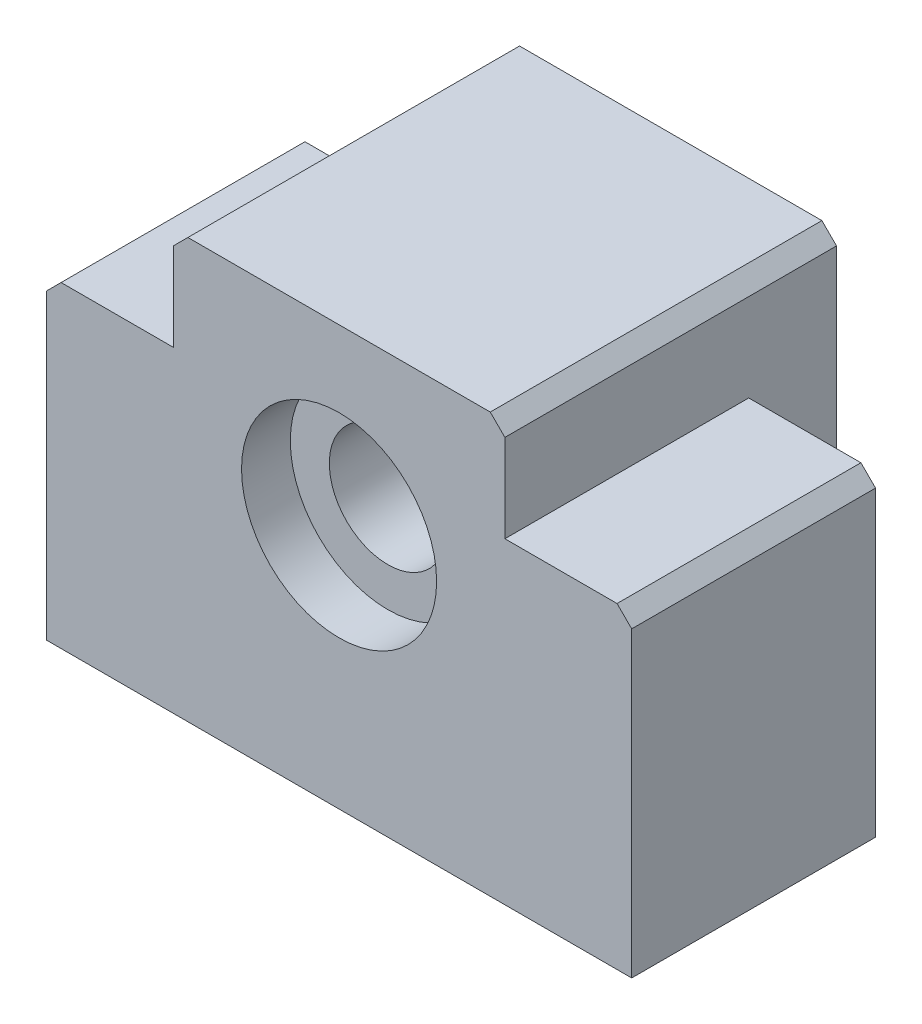
ISO-10303-21;
HEADER;
FILE_DESCRIPTION(('STEP AP214'),'2;1');
FILE_NAME('part.step','',(''),(''),'','','');
FILE_SCHEMA(('AUTOMOTIVE_DESIGN { 1 0 10303 214 1 1 1 1 }'));
ENDSEC;
DATA;
#1=APPLICATION_CONTEXT('core data for automotive mechanical design processes');
#2=APPLICATION_PROTOCOL_DEFINITION('international standard','automotive_design',2000,#1);
#3=PRODUCT_CONTEXT('',#1,'mechanical');
#4=PRODUCT('Part','Part','',(#3));
#5=PRODUCT_RELATED_PRODUCT_CATEGORY('part','',(#4));
#6=PRODUCT_DEFINITION_FORMATION('','',#4);
#7=PRODUCT_DEFINITION_CONTEXT('part definition',#1,'design');
#8=PRODUCT_DEFINITION('design','',#6,#7);
#9=PRODUCT_DEFINITION_SHAPE('','',#8);
#10=(LENGTH_UNIT() NAMED_UNIT(*) SI_UNIT(.MILLI.,.METRE.));
#11=(NAMED_UNIT(*) PLANE_ANGLE_UNIT() SI_UNIT($,.RADIAN.));
#12=(NAMED_UNIT(*) SI_UNIT($,.STERADIAN.) SOLID_ANGLE_UNIT());
#13=UNCERTAINTY_MEASURE_WITH_UNIT(LENGTH_MEASURE(1.E-05),#10,'distance_accuracy_value','');
#14=(GEOMETRIC_REPRESENTATION_CONTEXT(3) GLOBAL_UNCERTAINTY_ASSIGNED_CONTEXT((#13)) GLOBAL_UNIT_ASSIGNED_CONTEXT((#10,
#11,#12)) REPRESENTATION_CONTEXT('',''));
#15=CARTESIAN_POINT('',(0.,0.,0.));
#16=DIRECTION('',(0.,0.,1.));
#17=DIRECTION('',(1.,0.,0.));
#18=AXIS2_PLACEMENT_3D('',#15,#16,#17);
#19=CARTESIAN_POINT('',(-2.37420731041335E-13,8.95,-9.00000000000033));
#20=DIRECTION('',(0.,0.,1.));
#21=DIRECTION('',(1.,0.,0.));
#22=AXIS2_PLACEMENT_3D('',#19,#20,#21);
#23=CYLINDRICAL_SURFACE('',#22,6.);
#24=CARTESIAN_POINT('',(-1.32676290876039E-13,8.95,6.));
#25=DIRECTION('',(0.,0.,1.));
#26=DIRECTION('',(1.,0.,0.));
#27=AXIS2_PLACEMENT_3D('',#24,#25,#26);
#28=CIRCLE('',#27,6.);
#29=CARTESIAN_POINT('',(5.99999999999987,8.95,6.));
#30=VERTEX_POINT('',#29);
#31=EDGE_CURVE('E245',#30,#30,#28,.T.);
#32=ORIENTED_EDGE('',*,*,#31,.F.);
#33=EDGE_LOOP('',(#32));
#34=FACE_BOUND('',#33,.T.);
#35=CARTESIAN_POINT('',(0.,8.95,20.));
#36=DIRECTION('',(0.,0.,1.));
#37=DIRECTION('',(1.,0.,0.));
#38=AXIS2_PLACEMENT_3D('',#35,#36,#37);
#39=CIRCLE('',#38,6.);
#40=CARTESIAN_POINT('',(5.99999999999997,8.95,20.));
#41=VERTEX_POINT('',#40);
#42=EDGE_CURVE('E47',#41,#41,#39,.T.);
#43=ORIENTED_EDGE('',*,*,#42,.T.);
#44=EDGE_LOOP('',(#43));
#45=FACE_BOUND('',#44,.T.);
#46=ADVANCED_FACE('F42',(#34,#45),#23,.F.);
#47=CARTESIAN_POINT('',(-30.,16.25,25.));
#48=DIRECTION('',(0.,-1.,0.));
#49=DIRECTION('',(0.,0.,-1.));
#50=AXIS2_PLACEMENT_3D('',#47,#48,#49);
#51=PLANE('',#50);
#52=DIRECTION('',(-1.,0.,0.));
#53=VECTOR('',#52,1.);
#54=CARTESIAN_POINT('',(-30.,16.25,0.));
#55=LINE('',#54,#53);
#56=CARTESIAN_POINT('',(-17.0000000000002,16.25,0.));
#57=VERTEX_POINT('',#56);
#58=CARTESIAN_POINT('',(-28.5,16.25,0.));
#59=VERTEX_POINT('',#58);
#60=EDGE_CURVE('E196',#57,#59,#55,.T.);
#61=ORIENTED_EDGE('',*,*,#60,.T.);
#62=DIRECTION('',(0.,0.,1.));
#63=VECTOR('',#62,1.);
#64=CARTESIAN_POINT('',(-28.5,16.25,25.));
#65=LINE('',#64,#63);
#66=CARTESIAN_POINT('',(-28.5,16.25,25.));
#67=VERTEX_POINT('',#66);
#68=EDGE_CURVE('E239',#59,#67,#65,.T.);
#69=ORIENTED_EDGE('',*,*,#68,.T.);
#70=DIRECTION('',(-1.,0.,0.));
#71=VECTOR('',#70,1.);
#72=CARTESIAN_POINT('',(-30.,16.25,25.));
#73=LINE('',#72,#71);
#74=CARTESIAN_POINT('',(-17.,16.25,25.));
#75=VERTEX_POINT('',#74);
#76=EDGE_CURVE('E186',#75,#67,#73,.T.);
#77=ORIENTED_EDGE('',*,*,#76,.F.);
#78=DIRECTION('',(0.,0.,1.));
#79=VECTOR('',#78,1.);
#80=CARTESIAN_POINT('',(-17.,16.25,24.9999999999999));
#81=LINE('',#80,#79);
#82=EDGE_CURVE('E176',#57,#75,#81,.T.);
#83=ORIENTED_EDGE('',*,*,#82,.F.);
#84=EDGE_LOOP('',(#61,#69,#77,#83));
#85=FACE_BOUND('',#84,.T.);
#86=ADVANCED_FACE('F305',(#85),#51,.F.);
#87=CARTESIAN_POINT('',(28.5,16.25,25.));
#88=VERTEX_POINT('',#87);
#89=CARTESIAN_POINT('',(17.,16.25,25.));
#90=VERTEX_POINT('',#89);
#91=EDGE_CURVE('E188',#88,#90,#73,.T.);
#92=ORIENTED_EDGE('',*,*,#91,.F.);
#93=DIRECTION('',(0.,0.,-1.));
#94=VECTOR('',#93,1.);
#95=CARTESIAN_POINT('',(28.5,16.25,25.));
#96=LINE('',#95,#94);
#97=CARTESIAN_POINT('',(28.5,16.25,0.));
#98=VERTEX_POINT('',#97);
#99=EDGE_CURVE('E52',#88,#98,#96,.T.);
#100=ORIENTED_EDGE('',*,*,#99,.T.);
#101=CARTESIAN_POINT('',(16.9999999999998,16.25,0.));
#102=VERTEX_POINT('',#101);
#103=EDGE_CURVE('E197',#98,#102,#55,.T.);
#104=ORIENTED_EDGE('',*,*,#103,.T.);
#105=DIRECTION('',(0.,0.,-1.));
#106=VECTOR('',#105,1.);
#107=CARTESIAN_POINT('',(17.,16.25,24.9999999999997));
#108=LINE('',#107,#106);
#109=EDGE_CURVE('E172',#90,#102,#108,.T.);
#110=ORIENTED_EDGE('',*,*,#109,.F.);
#111=EDGE_LOOP('',(#92,#100,#104,#110));
#112=FACE_BOUND('',#111,.T.);
#113=ADVANCED_FACE('F273',(#112),#51,.F.);
#114=CARTESIAN_POINT('',(0.,0.,0.));
#115=DIRECTION('',(0.,0.,1.));
#116=DIRECTION('',(1.,0.,0.));
#117=AXIS2_PLACEMENT_3D('',#114,#115,#116);
#118=PLANE('',#117);
#119=DIRECTION('',(0.,-1.,0.));
#120=VECTOR('',#119,1.);
#121=CARTESIAN_POINT('',(-30.,16.25,0.));
#122=LINE('',#121,#120);
#123=CARTESIAN_POINT('',(-30.,14.75,0.));
#124=VERTEX_POINT('',#123);
#125=CARTESIAN_POINT('',(-30.,-16.25,0.));
#126=VERTEX_POINT('',#125);
#127=EDGE_CURVE('E199',#124,#126,#122,.T.);
#128=ORIENTED_EDGE('',*,*,#127,.F.);
#129=DIRECTION('',(-0.707106781186549,-0.707106781186546,0.));
#130=VECTOR('',#129,1.);
#131=CARTESIAN_POINT('',(-30.,14.75,0.));
#132=LINE('',#131,#130);
#133=EDGE_CURVE('E237',#124,#59,#132,.F.);
#134=ORIENTED_EDGE('',*,*,#133,.T.);
#135=ORIENTED_EDGE('',*,*,#60,.F.);
#136=DIRECTION('',(0.,1.,0.));
#137=VECTOR('',#136,1.);
#138=CARTESIAN_POINT('',(-17.0000000000002,0.,0.));
#139=LINE('',#138,#137);
#140=CARTESIAN_POINT('',(-17.0000000000002,-9.25000000000001,0.));
#141=VERTEX_POINT('',#140);
#142=EDGE_CURVE('E211',#141,#57,#139,.T.);
#143=ORIENTED_EDGE('',*,*,#142,.F.);
#144=DIRECTION('',(-1.,0.,0.));
#145=VECTOR('',#144,1.);
#146=CARTESIAN_POINT('',(0.,-9.25000000000001,0.));
#147=LINE('',#146,#145);
#148=CARTESIAN_POINT('',(16.9999999999998,-9.25000000000001,0.));
#149=VERTEX_POINT('',#148);
#150=EDGE_CURVE('E171',#149,#141,#147,.T.);
#151=ORIENTED_EDGE('',*,*,#150,.F.);
#152=DIRECTION('',(0.,-1.,0.));
#153=VECTOR('',#152,1.);
#154=CARTESIAN_POINT('',(16.9999999999998,0.,0.));
#155=LINE('',#154,#153);
#156=EDGE_CURVE('E207',#102,#149,#155,.T.);
#157=ORIENTED_EDGE('',*,*,#156,.F.);
#158=ORIENTED_EDGE('',*,*,#103,.F.);
#159=DIRECTION('',(-0.707106781186546,0.707106781186549,0.));
#160=VECTOR('',#159,1.);
#161=CARTESIAN_POINT('',(28.5,16.25,0.));
#162=LINE('',#161,#160);
#163=CARTESIAN_POINT('',(30.,14.75,0.));
#164=VERTEX_POINT('',#163);
#165=EDGE_CURVE('E235',#98,#164,#162,.F.);
#166=ORIENTED_EDGE('',*,*,#165,.T.);
#167=DIRECTION('',(0.,1.,0.));
#168=VECTOR('',#167,1.);
#169=CARTESIAN_POINT('',(30.,16.25,0.));
#170=LINE('',#169,#168);
#171=CARTESIAN_POINT('',(30.,-16.25,0.));
#172=VERTEX_POINT('',#171);
#173=EDGE_CURVE('E183',#172,#164,#170,.T.);
#174=ORIENTED_EDGE('',*,*,#173,.F.);
#175=DIRECTION('',(1.,0.,0.));
#176=VECTOR('',#175,1.);
#177=CARTESIAN_POINT('',(-30.,-16.25,0.));
#178=LINE('',#177,#176);
#179=EDGE_CURVE('E187',#126,#172,#178,.T.);
#180=ORIENTED_EDGE('',*,*,#179,.F.);
#181=EDGE_LOOP('',(#128,#134,#135,#143,#151,#157,#158,#166,#174,#180));
#182=FACE_BOUND('',#181,.T.);
#183=ADVANCED_FACE('F279',(#182),#118,.F.);
#184=CARTESIAN_POINT('',(30.,16.25,25.));
#185=DIRECTION('',(-1.,0.,0.));
#186=DIRECTION('',(0.,-1.,0.));
#187=AXIS2_PLACEMENT_3D('',#184,#185,#186);
#188=PLANE('',#187);
#189=ORIENTED_EDGE('',*,*,#173,.T.);
#190=DIRECTION('',(0.,0.,1.));
#191=VECTOR('',#190,1.);
#192=CARTESIAN_POINT('',(30.,14.75,25.));
#193=LINE('',#192,#191);
#194=CARTESIAN_POINT('',(30.,14.75,25.));
#195=VERTEX_POINT('',#194);
#196=EDGE_CURVE('E11',#164,#195,#193,.T.);
#197=ORIENTED_EDGE('',*,*,#196,.T.);
#198=DIRECTION('',(0.,1.,0.));
#199=VECTOR('',#198,1.);
#200=CARTESIAN_POINT('',(30.,16.25,25.));
#201=LINE('',#200,#199);
#202=CARTESIAN_POINT('',(30.,-16.25,25.));
#203=VERTEX_POINT('',#202);
#204=EDGE_CURVE('E184',#203,#195,#201,.T.);
#205=ORIENTED_EDGE('',*,*,#204,.F.);
#206=DIRECTION('',(0.,0.,-1.));
#207=VECTOR('',#206,1.);
#208=CARTESIAN_POINT('',(30.,-16.25,25.));
#209=LINE('',#208,#207);
#210=EDGE_CURVE('E194',#203,#172,#209,.T.);
#211=ORIENTED_EDGE('',*,*,#210,.T.);
#212=EDGE_LOOP('',(#189,#197,#205,#211));
#213=FACE_BOUND('',#212,.T.);
#214=ADVANCED_FACE('F335',(#213),#188,.F.);
#215=CARTESIAN_POINT('',(-30.,16.25,25.));
#216=DIRECTION('',(1.,0.,0.));
#217=DIRECTION('',(0.,1.,0.));
#218=AXIS2_PLACEMENT_3D('',#215,#216,#217);
#219=PLANE('',#218);
#220=DIRECTION('',(0.,-1.,0.));
#221=VECTOR('',#220,1.);
#222=CARTESIAN_POINT('',(-30.,16.25,25.));
#223=LINE('',#222,#221);
#224=CARTESIAN_POINT('',(-30.,14.75,25.));
#225=VERTEX_POINT('',#224);
#226=CARTESIAN_POINT('',(-30.,-16.25,25.));
#227=VERTEX_POINT('',#226);
#228=EDGE_CURVE('E190',#225,#227,#223,.T.);
#229=ORIENTED_EDGE('',*,*,#228,.F.);
#230=DIRECTION('',(0.,0.,-1.));
#231=VECTOR('',#230,1.);
#232=CARTESIAN_POINT('',(-30.,14.75,25.));
#233=LINE('',#232,#231);
#234=EDGE_CURVE('E232',#225,#124,#233,.T.);
#235=ORIENTED_EDGE('',*,*,#234,.T.);
#236=ORIENTED_EDGE('',*,*,#127,.T.);
#237=DIRECTION('',(0.,0.,-1.));
#238=VECTOR('',#237,1.);
#239=CARTESIAN_POINT('',(-30.,-16.25,25.));
#240=LINE('',#239,#238);
#241=EDGE_CURVE('E204',#227,#126,#240,.T.);
#242=ORIENTED_EDGE('',*,*,#241,.F.);
#243=EDGE_LOOP('',(#229,#235,#236,#242));
#244=FACE_BOUND('',#243,.T.);
#245=ADVANCED_FACE('F338',(#244),#219,.F.);
#246=CARTESIAN_POINT('',(-30.,-16.25,25.));
#247=DIRECTION('',(0.,1.,0.));
#248=DIRECTION('',(0.,0.,1.));
#249=AXIS2_PLACEMENT_3D('',#246,#247,#248);
#250=PLANE('',#249);
#251=ORIENTED_EDGE('',*,*,#179,.T.);
#252=ORIENTED_EDGE('',*,*,#210,.F.);
#253=DIRECTION('',(1.,0.,0.));
#254=VECTOR('',#253,1.);
#255=CARTESIAN_POINT('',(-30.,-16.25,25.));
#256=LINE('',#255,#254);
#257=EDGE_CURVE('E192',#227,#203,#256,.T.);
#258=ORIENTED_EDGE('',*,*,#257,.F.);
#259=ORIENTED_EDGE('',*,*,#241,.T.);
#260=EDGE_LOOP('',(#251,#252,#258,#259));
#261=FACE_BOUND('',#260,.T.);
#262=ADVANCED_FACE('F331',(#261),#250,.F.);
#263=CARTESIAN_POINT('',(0.,0.,25.));
#264=DIRECTION('',(0.,0.,1.));
#265=DIRECTION('',(1.,0.,0.));
#266=AXIS2_PLACEMENT_3D('',#263,#264,#265);
#267=PLANE('',#266);
#268=CARTESIAN_POINT('',(-2.37420731041335E-13,8.95,25.));
#269=DIRECTION('',(0.,0.,1.));
#270=DIRECTION('',(1.,0.,0.));
#271=AXIS2_PLACEMENT_3D('',#268,#269,#270);
#272=CIRCLE('',#271,10.0000000000002);
#273=CARTESIAN_POINT('',(9.99999999999999,8.95,25.));
#274=VERTEX_POINT('',#273);
#275=EDGE_CURVE('E261',#274,#274,#272,.T.);
#276=ORIENTED_EDGE('',*,*,#275,.F.);
#277=EDGE_LOOP('',(#276));
#278=FACE_BOUND('',#277,.T.);
#279=ORIENTED_EDGE('',*,*,#76,.T.);
#280=DIRECTION('',(0.707106781186549,0.707106781186546,0.));
#281=VECTOR('',#280,1.);
#282=CARTESIAN_POINT('',(-22.3749999999999,22.375,25.));
#283=LINE('',#282,#281);
#284=EDGE_CURVE('E242',#67,#225,#283,.F.);
#285=ORIENTED_EDGE('',*,*,#284,.T.);
#286=ORIENTED_EDGE('',*,*,#228,.T.);
#287=ORIENTED_EDGE('',*,*,#257,.T.);
#288=ORIENTED_EDGE('',*,*,#204,.T.);
#289=DIRECTION('',(0.707106781186546,-0.707106781186549,0.));
#290=VECTOR('',#289,1.);
#291=CARTESIAN_POINT('',(22.3750000000001,22.375,25.));
#292=LINE('',#291,#290);
#293=EDGE_CURVE('E60',#195,#88,#292,.F.);
#294=ORIENTED_EDGE('',*,*,#293,.T.);
#295=ORIENTED_EDGE('',*,*,#91,.T.);
#296=DIRECTION('',(0.,-1.,0.));
#297=VECTOR('',#296,1.);
#298=CARTESIAN_POINT('',(17.,16.25,24.9999999999999));
#299=LINE('',#298,#297);
#300=CARTESIAN_POINT('',(17.,25.25,24.9999999999999));
#301=VERTEX_POINT('',#300);
#302=EDGE_CURVE('E167',#301,#90,#299,.T.);
#303=ORIENTED_EDGE('',*,*,#302,.F.);
#304=DIRECTION('',(0.707106781186545,-0.70710678118655,0.));
#305=VECTOR('',#304,1.);
#306=CARTESIAN_POINT('',(21.125,21.1249999999999,25.));
#307=LINE('',#306,#305);
#308=CARTESIAN_POINT('',(15.5,26.75,24.9999999999999));
#309=VERTEX_POINT('',#308);
#310=EDGE_CURVE('E216',#301,#309,#307,.F.);
#311=ORIENTED_EDGE('',*,*,#310,.T.);
#312=DIRECTION('',(1.,0.,0.));
#313=VECTOR('',#312,1.);
#314=CARTESIAN_POINT('',(17.,26.75,24.9999999999999));
#315=LINE('',#314,#313);
#316=CARTESIAN_POINT('',(-15.5,26.75,25.0000000000001));
#317=VERTEX_POINT('',#316);
#318=EDGE_CURVE('E251',#317,#309,#315,.T.);
#319=ORIENTED_EDGE('',*,*,#318,.F.);
#320=DIRECTION('',(0.707106781186546,0.707106781186549,0.));
#321=VECTOR('',#320,1.);
#322=CARTESIAN_POINT('',(-21.125,21.1249999999999,25.));
#323=LINE('',#322,#321);
#324=CARTESIAN_POINT('',(-17.,25.25,25.0000000000001));
#325=VERTEX_POINT('',#324);
#326=EDGE_CURVE('E227',#317,#325,#323,.F.);
#327=ORIENTED_EDGE('',*,*,#326,.T.);
#328=DIRECTION('',(0.,1.,0.));
#329=VECTOR('',#328,1.);
#330=CARTESIAN_POINT('',(-17.,26.75,25.0000000000001));
#331=LINE('',#330,#329);
#332=EDGE_CURVE('E247',#75,#325,#331,.T.);
#333=ORIENTED_EDGE('',*,*,#332,.F.);
#334=EDGE_LOOP('',(#279,#285,#286,#287,#288,#294,#295,#303,#311,#319,#327,#333));
#335=FACE_BOUND('',#334,.T.);
#336=ADVANCED_FACE('F286',(#278,#335),#267,.T.);
#337=CARTESIAN_POINT('',(16.9999999999998,-9.25000000000001,-9.00000000000012));
#338=DIRECTION('',(0.,1.,0.));
#339=DIRECTION('',(0.,0.,1.));
#340=AXIS2_PLACEMENT_3D('',#337,#338,#339);
#341=PLANE('',#340);
#342=DIRECTION('',(0.,0.,1.));
#343=VECTOR('',#342,1.);
#344=CARTESIAN_POINT('',(16.9999999999998,-9.25000000000001,-9.00000000000012));
#345=LINE('',#344,#343);
#346=CARTESIAN_POINT('',(16.9999999999998,-9.25000000000001,-9.00000000000012));
#347=VERTEX_POINT('',#346);
#348=EDGE_CURVE('E173',#347,#149,#345,.T.);
#349=ORIENTED_EDGE('',*,*,#348,.T.);
#350=ORIENTED_EDGE('',*,*,#150,.T.);
#351=DIRECTION('',(0.,0.,1.));
#352=VECTOR('',#351,1.);
#353=CARTESIAN_POINT('',(-17.0000000000002,-9.25000000000001,-8.99999999999988));
#354=LINE('',#353,#352);
#355=CARTESIAN_POINT('',(-17.0000000000002,-9.25000000000001,-8.99999999999988));
#356=VERTEX_POINT('',#355);
#357=EDGE_CURVE('E152',#356,#141,#354,.T.);
#358=ORIENTED_EDGE('',*,*,#357,.F.);
#359=DIRECTION('',(-1.,0.,0.));
#360=VECTOR('',#359,1.);
#361=CARTESIAN_POINT('',(16.9999999999998,-9.25000000000001,-9.00000000000012));
#362=LINE('',#361,#360);
#363=EDGE_CURVE('E158',#347,#356,#362,.T.);
#364=ORIENTED_EDGE('',*,*,#363,.F.);
#365=EDGE_LOOP('',(#349,#350,#358,#364));
#366=FACE_BOUND('',#365,.T.);
#367=ADVANCED_FACE('F170',(#366),#341,.F.);
#368=CARTESIAN_POINT('',(-17.0000000000002,26.75,-8.99999999999988));
#369=DIRECTION('',(1.,0.,0.));
#370=DIRECTION('',(0.,0.,-1.));
#371=AXIS2_PLACEMENT_3D('',#368,#369,#370);
#372=PLANE('',#371);
#373=ORIENTED_EDGE('',*,*,#332,.T.);
#374=DIRECTION('',(0.,0.,-1.));
#375=VECTOR('',#374,1.);
#376=CARTESIAN_POINT('',(-17.0000000000002,25.25,-8.99999999999988));
#377=LINE('',#376,#375);
#378=CARTESIAN_POINT('',(-17.0000000000002,25.25,-8.99999999999988));
#379=VERTEX_POINT('',#378);
#380=EDGE_CURVE('E154',#325,#379,#377,.T.);
#381=ORIENTED_EDGE('',*,*,#380,.T.);
#382=DIRECTION('',(0.,1.,0.));
#383=VECTOR('',#382,1.);
#384=CARTESIAN_POINT('',(-17.0000000000002,-9.25000000000001,-8.99999999999988));
#385=LINE('',#384,#383);
#386=EDGE_CURVE('E146',#356,#379,#385,.T.);
#387=ORIENTED_EDGE('',*,*,#386,.F.);
#388=ORIENTED_EDGE('',*,*,#357,.T.);
#389=ORIENTED_EDGE('',*,*,#142,.T.);
#390=ORIENTED_EDGE('',*,*,#82,.T.);
#391=EDGE_LOOP('',(#373,#381,#387,#388,#389,#390));
#392=FACE_BOUND('',#391,.T.);
#393=ADVANCED_FACE('F149',(#392),#372,.F.);
#394=CARTESIAN_POINT('',(16.9999999999998,16.25,-9.00000000000012));
#395=DIRECTION('',(-1.,0.,0.));
#396=DIRECTION('',(0.,0.,1.));
#397=AXIS2_PLACEMENT_3D('',#394,#395,#396);
#398=PLANE('',#397);
#399=DIRECTION('',(0.,-1.,0.));
#400=VECTOR('',#399,1.);
#401=CARTESIAN_POINT('',(16.9999999999998,16.25,-9.00000000000012));
#402=LINE('',#401,#400);
#403=CARTESIAN_POINT('',(16.9999999999998,25.25,-9.00000000000012));
#404=VERTEX_POINT('',#403);
#405=EDGE_CURVE('E163',#404,#347,#402,.T.);
#406=ORIENTED_EDGE('',*,*,#405,.F.);
#407=DIRECTION('',(0.,0.,1.));
#408=VECTOR('',#407,1.);
#409=CARTESIAN_POINT('',(16.9999999999998,25.25,-9.00000000000012));
#410=LINE('',#409,#408);
#411=EDGE_CURVE('E213',#404,#301,#410,.T.);
#412=ORIENTED_EDGE('',*,*,#411,.T.);
#413=ORIENTED_EDGE('',*,*,#302,.T.);
#414=ORIENTED_EDGE('',*,*,#109,.T.);
#415=ORIENTED_EDGE('',*,*,#156,.T.);
#416=ORIENTED_EDGE('',*,*,#348,.F.);
#417=EDGE_LOOP('',(#406,#412,#413,#414,#415,#416));
#418=FACE_BOUND('',#417,.T.);
#419=ADVANCED_FACE('F270',(#418),#398,.F.);
#420=CARTESIAN_POINT('',(16.9999999999998,26.75,-9.00000000000012));
#421=DIRECTION('',(0.,-1.,0.));
#422=DIRECTION('',(0.,0.,-1.));
#423=AXIS2_PLACEMENT_3D('',#420,#421,#422);
#424=PLANE('',#423);
#425=DIRECTION('',(1.,0.,0.));
#426=VECTOR('',#425,1.);
#427=CARTESIAN_POINT('',(16.9999999999998,26.75,-9.00000000000012));
#428=LINE('',#427,#426);
#429=CARTESIAN_POINT('',(-15.5000000000002,26.75,-8.99999999999989));
#430=VERTEX_POINT('',#429);
#431=CARTESIAN_POINT('',(15.4999999999998,26.75,-9.00000000000011));
#432=VERTEX_POINT('',#431);
#433=EDGE_CURVE('E157',#430,#432,#428,.T.);
#434=ORIENTED_EDGE('',*,*,#433,.F.);
#435=DIRECTION('',(0.,0.,1.));
#436=VECTOR('',#435,1.);
#437=CARTESIAN_POINT('',(-15.5000000000002,26.75,-8.99999999999989));
#438=LINE('',#437,#436);
#439=EDGE_CURVE('E224',#430,#317,#438,.T.);
#440=ORIENTED_EDGE('',*,*,#439,.T.);
#441=ORIENTED_EDGE('',*,*,#318,.T.);
#442=DIRECTION('',(0.,0.,-1.));
#443=VECTOR('',#442,1.);
#444=CARTESIAN_POINT('',(15.4999999999998,26.75,-9.00000000000011));
#445=LINE('',#444,#443);
#446=EDGE_CURVE('E219',#309,#432,#445,.T.);
#447=ORIENTED_EDGE('',*,*,#446,.T.);
#448=EDGE_LOOP('',(#434,#440,#441,#447));
#449=FACE_BOUND('',#448,.T.);
#450=ADVANCED_FACE('F290',(#449),#424,.F.);
#451=CARTESIAN_POINT('',(0.,0.,-9.));
#452=DIRECTION('',(0.,0.,-1.));
#453=DIRECTION('',(-1.,0.,0.));
#454=AXIS2_PLACEMENT_3D('',#451,#452,#453);
#455=PLANE('',#454);
#456=CARTESIAN_POINT('',(-2.37420731041335E-13,8.95,-9.));
#457=DIRECTION('',(0.,0.,1.));
#458=DIRECTION('',(1.,0.,0.));
#459=AXIS2_PLACEMENT_3D('',#456,#457,#458);
#460=CIRCLE('',#459,10.);
#461=CARTESIAN_POINT('',(9.99999999999976,8.95,-9.));
#462=VERTEX_POINT('',#461);
#463=EDGE_CURVE('E254',#462,#462,#460,.T.);
#464=ORIENTED_EDGE('',*,*,#463,.T.);
#465=EDGE_LOOP('',(#464));
#466=FACE_BOUND('',#465,.T.);
#467=ORIENTED_EDGE('',*,*,#386,.T.);
#468=DIRECTION('',(-0.707106781186546,-0.707106781186549,0.));
#469=VECTOR('',#468,1.);
#470=CARTESIAN_POINT('',(-21.1250000000002,21.125,-8.99999999999985));
#471=LINE('',#470,#469);
#472=EDGE_CURVE('E230',#379,#430,#471,.F.);
#473=ORIENTED_EDGE('',*,*,#472,.T.);
#474=ORIENTED_EDGE('',*,*,#433,.T.);
#475=DIRECTION('',(-0.707106781186545,0.70710678118655,0.));
#476=VECTOR('',#475,1.);
#477=CARTESIAN_POINT('',(21.1249999999999,21.1249999999998,-9.00000000000015));
#478=LINE('',#477,#476);
#479=EDGE_CURVE('E222',#432,#404,#478,.F.);
#480=ORIENTED_EDGE('',*,*,#479,.T.);
#481=ORIENTED_EDGE('',*,*,#405,.T.);
#482=ORIENTED_EDGE('',*,*,#363,.T.);
#483=EDGE_LOOP('',(#467,#473,#474,#480,#481,#482));
#484=FACE_BOUND('',#483,.T.);
#485=ADVANCED_FACE('F161',(#466,#484),#455,.T.);
#486=CARTESIAN_POINT('',(16.9999999999998,25.25,-9.00000000000012));
#487=DIRECTION('',(-0.70710678118655,-0.707106781186545,0.));
#488=DIRECTION('',(0.,0.,1.));
#489=AXIS2_PLACEMENT_3D('',#486,#487,#488);
#490=PLANE('',#489);
#491=ORIENTED_EDGE('',*,*,#479,.F.);
#492=ORIENTED_EDGE('',*,*,#446,.F.);
#493=ORIENTED_EDGE('',*,*,#310,.F.);
#494=ORIENTED_EDGE('',*,*,#411,.F.);
#495=EDGE_LOOP('',(#491,#492,#493,#494));
#496=FACE_BOUND('',#495,.T.);
#497=ADVANCED_FACE('F282',(#496),#490,.F.);
#498=CARTESIAN_POINT('',(-15.5000000000002,26.75,-8.99999999999989));
#499=DIRECTION('',(0.707106781186549,-0.707106781186546,0.));
#500=DIRECTION('',(0.,0.,1.));
#501=AXIS2_PLACEMENT_3D('',#498,#499,#500);
#502=PLANE('',#501);
#503=ORIENTED_EDGE('',*,*,#472,.F.);
#504=ORIENTED_EDGE('',*,*,#380,.F.);
#505=ORIENTED_EDGE('',*,*,#326,.F.);
#506=ORIENTED_EDGE('',*,*,#439,.F.);
#507=EDGE_LOOP('',(#503,#504,#505,#506));
#508=FACE_BOUND('',#507,.T.);
#509=ADVANCED_FACE('F293',(#508),#502,.F.);
#510=CARTESIAN_POINT('',(-30.,14.75,25.));
#511=DIRECTION('',(0.707106781186546,-0.707106781186549,0.));
#512=DIRECTION('',(0.,0.,-1.));
#513=AXIS2_PLACEMENT_3D('',#510,#511,#512);
#514=PLANE('',#513);
#515=ORIENTED_EDGE('',*,*,#284,.F.);
#516=ORIENTED_EDGE('',*,*,#68,.F.);
#517=ORIENTED_EDGE('',*,*,#133,.F.);
#518=ORIENTED_EDGE('',*,*,#234,.F.);
#519=EDGE_LOOP('',(#515,#516,#517,#518));
#520=FACE_BOUND('',#519,.T.);
#521=ADVANCED_FACE('F295',(#520),#514,.F.);
#522=CARTESIAN_POINT('',(28.5,16.25,25.));
#523=DIRECTION('',(-0.707106781186549,-0.707106781186546,0.));
#524=DIRECTION('',(0.,0.,-1.));
#525=AXIS2_PLACEMENT_3D('',#522,#523,#524);
#526=PLANE('',#525);
#527=ORIENTED_EDGE('',*,*,#293,.F.);
#528=ORIENTED_EDGE('',*,*,#196,.F.);
#529=ORIENTED_EDGE('',*,*,#165,.F.);
#530=ORIENTED_EDGE('',*,*,#99,.F.);
#531=EDGE_LOOP('',(#527,#528,#529,#530));
#532=FACE_BOUND('',#531,.T.);
#533=ADVANCED_FACE('F45',(#532),#526,.F.);
#534=CARTESIAN_POINT('',(-2.37420731041335E-13,8.95,6.));
#535=DIRECTION('',(0.,0.,-1.));
#536=DIRECTION('',(-1.,0.,0.));
#537=AXIS2_PLACEMENT_3D('',#534,#535,#536);
#538=CYLINDRICAL_SURFACE('',#537,10.);
#539=CARTESIAN_POINT('',(-2.37420731041335E-13,8.95,6.));
#540=DIRECTION('',(0.,0.,1.));
#541=DIRECTION('',(1.,0.,0.));
#542=AXIS2_PLACEMENT_3D('',#539,#540,#541);
#543=CIRCLE('',#542,10.);
#544=CARTESIAN_POINT('',(9.99999999999976,8.95,6.));
#545=VERTEX_POINT('',#544);
#546=EDGE_CURVE('E248',#545,#545,#543,.T.);
#547=ORIENTED_EDGE('',*,*,#546,.T.);
#548=EDGE_LOOP('',(#547));
#549=FACE_BOUND('',#548,.T.);
#550=ORIENTED_EDGE('',*,*,#463,.F.);
#551=EDGE_LOOP('',(#550));
#552=FACE_BOUND('',#551,.T.);
#553=ADVANCED_FACE('F316',(#549,#552),#538,.F.);
#554=CARTESIAN_POINT('',(-2.37420731041335E-13,8.95,6.));
#555=DIRECTION('',(0.,0.,1.));
#556=DIRECTION('',(1.,0.,0.));
#557=AXIS2_PLACEMENT_3D('',#554,#555,#556);
#558=PLANE('',#557);
#559=ORIENTED_EDGE('',*,*,#31,.T.);
#560=EDGE_LOOP('',(#559));
#561=FACE_BOUND('',#560,.T.);
#562=ORIENTED_EDGE('',*,*,#546,.F.);
#563=EDGE_LOOP('',(#562));
#564=FACE_BOUND('',#563,.T.);
#565=ADVANCED_FACE('F364',(#561,#564),#558,.F.);
#566=CARTESIAN_POINT('',(-2.37420731041335E-13,8.95,20.));
#567=DIRECTION('',(0.,0.,1.));
#568=DIRECTION('',(1.,0.,0.));
#569=AXIS2_PLACEMENT_3D('',#566,#567,#568);
#570=CYLINDRICAL_SURFACE('',#569,10.0000000000002);
#571=CARTESIAN_POINT('',(-2.37420731041335E-13,8.95,20.));
#572=DIRECTION('',(0.,0.,1.));
#573=DIRECTION('',(1.,0.,0.));
#574=AXIS2_PLACEMENT_3D('',#571,#572,#573);
#575=CIRCLE('',#574,10.0000000000002);
#576=CARTESIAN_POINT('',(9.99999999999999,8.95,20.));
#577=VERTEX_POINT('',#576);
#578=EDGE_CURVE('E388',#577,#577,#575,.T.);
#579=ORIENTED_EDGE('',*,*,#578,.F.);
#580=EDGE_LOOP('',(#579));
#581=FACE_BOUND('',#580,.T.);
#582=ORIENTED_EDGE('',*,*,#275,.T.);
#583=EDGE_LOOP('',(#582));
#584=FACE_BOUND('',#583,.T.);
#585=ADVANCED_FACE('F368',(#581,#584),#570,.F.);
#586=CARTESIAN_POINT('',(-2.37420731041335E-13,8.95,20.));
#587=DIRECTION('',(0.,0.,1.));
#588=DIRECTION('',(1.,0.,0.));
#589=AXIS2_PLACEMENT_3D('',#586,#587,#588);
#590=PLANE('',#589);
#591=ORIENTED_EDGE('',*,*,#42,.F.);
#592=EDGE_LOOP('',(#591));
#593=FACE_BOUND('',#592,.T.);
#594=ORIENTED_EDGE('',*,*,#578,.T.);
#595=EDGE_LOOP('',(#594));
#596=FACE_BOUND('',#595,.T.);
#597=ADVANCED_FACE('F374',(#593,#596),#590,.T.);
#598=CLOSED_SHELL('',(#46,#86,#113,#183,#214,#245,#262,#336,#367,#393,#419,#450,#485,#497,#509,
#521,#533,#553,#565,#585,#597));
#599=MANIFOLD_SOLID_BREP('B2',#598);
#600=ADVANCED_BREP_SHAPE_REPRESENTATION('',(#18,#599),#14);
#601=SHAPE_DEFINITION_REPRESENTATION(#9,#600);
ENDSEC;
END-ISO-10303-21;
